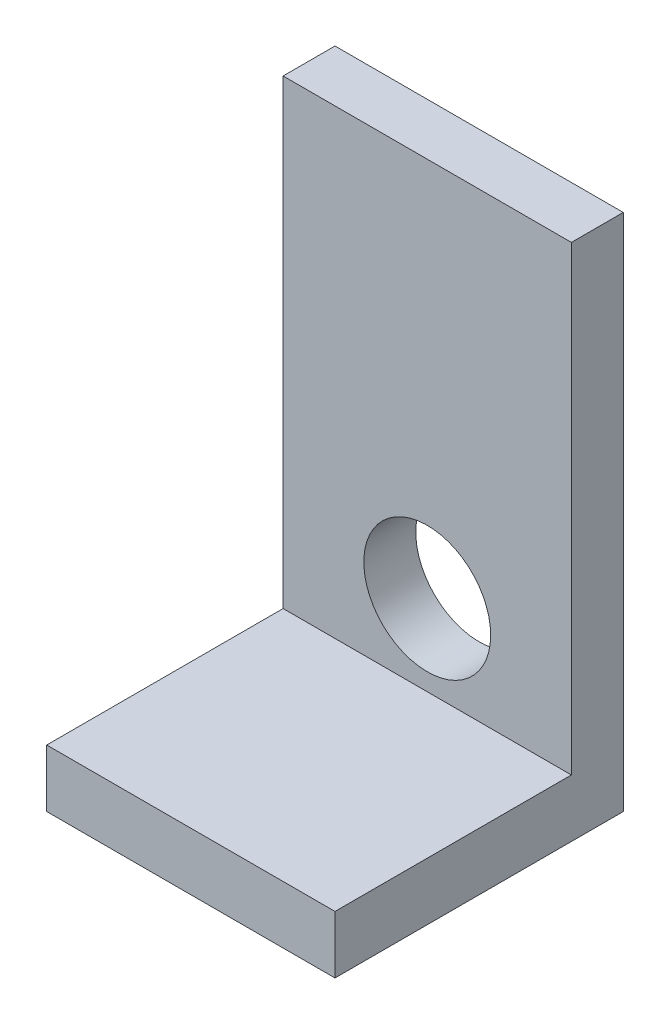
ISO-10303-21;
HEADER;
FILE_DESCRIPTION(('STEP AP214'),'2;1');
FILE_NAME('part.step','',(''),(''),'','','');
FILE_SCHEMA(('AUTOMOTIVE_DESIGN { 1 0 10303 214 1 1 1 1 }'));
ENDSEC;
DATA;
#1=APPLICATION_CONTEXT('core data for automotive mechanical design processes');
#2=APPLICATION_PROTOCOL_DEFINITION('international standard','automotive_design',2000,#1);
#3=PRODUCT_CONTEXT('',#1,'mechanical');
#4=PRODUCT('Part','Part','',(#3));
#5=PRODUCT_RELATED_PRODUCT_CATEGORY('part','',(#4));
#6=PRODUCT_DEFINITION_FORMATION('','',#4);
#7=PRODUCT_DEFINITION_CONTEXT('part definition',#1,'design');
#8=PRODUCT_DEFINITION('design','',#6,#7);
#9=PRODUCT_DEFINITION_SHAPE('','',#8);
#10=(LENGTH_UNIT() NAMED_UNIT(*) SI_UNIT(.MILLI.,.METRE.));
#11=(NAMED_UNIT(*) PLANE_ANGLE_UNIT() SI_UNIT($,.RADIAN.));
#12=(NAMED_UNIT(*) SI_UNIT($,.STERADIAN.) SOLID_ANGLE_UNIT());
#13=UNCERTAINTY_MEASURE_WITH_UNIT(LENGTH_MEASURE(1.E-05),#10,'distance_accuracy_value','');
#14=(GEOMETRIC_REPRESENTATION_CONTEXT(3) GLOBAL_UNCERTAINTY_ASSIGNED_CONTEXT((#13)) GLOBAL_UNIT_ASSIGNED_CONTEXT((#10,
#11,#12)) REPRESENTATION_CONTEXT('',''));
#15=CARTESIAN_POINT('',(0.,0.,0.));
#16=DIRECTION('',(0.,0.,1.));
#17=DIRECTION('',(1.,0.,0.));
#18=AXIS2_PLACEMENT_3D('',#15,#16,#17);
#19=CARTESIAN_POINT('',(3.17499999999996,1.27,-3.175));
#20=DIRECTION('',(-1.,0.,0.));
#21=DIRECTION('',(0.,0.,1.));
#22=AXIS2_PLACEMENT_3D('',#19,#20,#21);
#23=PLANE('',#22);
#24=DIRECTION('',(0.,0.,-1.));
#25=VECTOR('',#24,1.);
#26=CARTESIAN_POINT('',(3.17499999999996,0.,-3.175));
#27=LINE('',#26,#25);
#28=CARTESIAN_POINT('',(3.17499999999996,0.,3.175));
#29=VERTEX_POINT('',#28);
#30=CARTESIAN_POINT('',(3.17499999999996,0.,-3.175));
#31=VERTEX_POINT('',#30);
#32=EDGE_CURVE('E88',#29,#31,#27,.T.);
#33=ORIENTED_EDGE('',*,*,#32,.T.);
#34=DIRECTION('',(0.,-1.,0.));
#35=VECTOR('',#34,1.);
#36=CARTESIAN_POINT('',(3.17499999999996,1.27,-3.175));
#37=LINE('',#36,#35);
#38=CARTESIAN_POINT('',(3.17499999999996,11.43,-3.175));
#39=VERTEX_POINT('',#38);
#40=EDGE_CURVE('E11',#39,#31,#37,.T.);
#41=ORIENTED_EDGE('',*,*,#40,.F.);
#42=DIRECTION('',(0.,0.,-1.));
#43=VECTOR('',#42,1.);
#44=CARTESIAN_POINT('',(3.17499999999996,11.43,-3.175));
#45=LINE('',#44,#43);
#46=CARTESIAN_POINT('',(3.17499999999996,11.43,-2.032));
#47=VERTEX_POINT('',#46);
#48=EDGE_CURVE('E124',#47,#39,#45,.T.);
#49=ORIENTED_EDGE('',*,*,#48,.F.);
#50=DIRECTION('',(0.,-1.,0.));
#51=VECTOR('',#50,1.);
#52=CARTESIAN_POINT('',(3.17499999999996,11.43,-2.032));
#53=LINE('',#52,#51);
#54=CARTESIAN_POINT('',(3.17499999999996,1.27,-2.032));
#55=VERTEX_POINT('',#54);
#56=EDGE_CURVE('E97',#47,#55,#53,.T.);
#57=ORIENTED_EDGE('',*,*,#56,.T.);
#58=DIRECTION('',(0.,0.,-1.));
#59=VECTOR('',#58,1.);
#60=CARTESIAN_POINT('',(3.17499999999996,1.27,-3.175));
#61=LINE('',#60,#59);
#62=CARTESIAN_POINT('',(3.17499999999996,1.27,3.175));
#63=VERTEX_POINT('',#62);
#64=EDGE_CURVE('E82',#63,#55,#61,.T.);
#65=ORIENTED_EDGE('',*,*,#64,.F.);
#66=DIRECTION('',(0.,-1.,0.));
#67=VECTOR('',#66,1.);
#68=CARTESIAN_POINT('',(3.17499999999996,1.27,3.175));
#69=LINE('',#68,#67);
#70=EDGE_CURVE('E75',#63,#29,#69,.T.);
#71=ORIENTED_EDGE('',*,*,#70,.T.);
#72=EDGE_LOOP('',(#33,#41,#49,#57,#65,#71));
#73=FACE_BOUND('',#72,.T.);
#74=ADVANCED_FACE('F33',(#73),#23,.F.);
#75=CARTESIAN_POINT('',(-3.17500000000003,1.27,-3.175));
#76=DIRECTION('',(0.,0.,1.));
#77=DIRECTION('',(1.,0.,0.));
#78=AXIS2_PLACEMENT_3D('',#75,#76,#77);
#79=PLANE('',#78);
#80=CARTESIAN_POINT('',(0.,3.048,-3.175));
#81=DIRECTION('',(0.,0.,1.));
#82=DIRECTION('',(1.,0.,0.));
#83=AXIS2_PLACEMENT_3D('',#80,#81,#82);
#84=CIRCLE('',#83,1.397);
#85=CARTESIAN_POINT('',(1.397,3.048,-3.175));
#86=VERTEX_POINT('',#85);
#87=EDGE_CURVE('E131',#86,#86,#84,.F.);
#88=ORIENTED_EDGE('',*,*,#87,.F.);
#89=EDGE_LOOP('',(#88));
#90=FACE_BOUND('',#89,.T.);
#91=DIRECTION('',(-1.,0.,0.));
#92=VECTOR('',#91,1.);
#93=CARTESIAN_POINT('',(-3.17500000000003,0.,-3.175));
#94=LINE('',#93,#92);
#95=CARTESIAN_POINT('',(-3.17500000000003,0.,-3.175));
#96=VERTEX_POINT('',#95);
#97=EDGE_CURVE('E92',#31,#96,#94,.T.);
#98=ORIENTED_EDGE('',*,*,#97,.T.);
#99=DIRECTION('',(0.,-1.,0.));
#100=VECTOR('',#99,1.);
#101=CARTESIAN_POINT('',(-3.17500000000003,1.27,-3.175));
#102=LINE('',#101,#100);
#103=CARTESIAN_POINT('',(-3.17500000000003,11.43,-3.175));
#104=VERTEX_POINT('',#103);
#105=EDGE_CURVE('E40',#104,#96,#102,.T.);
#106=ORIENTED_EDGE('',*,*,#105,.F.);
#107=DIRECTION('',(-1.,0.,0.));
#108=VECTOR('',#107,1.);
#109=CARTESIAN_POINT('',(-3.17500000000003,11.43,-3.175));
#110=LINE('',#109,#108);
#111=EDGE_CURVE('E116',#39,#104,#110,.T.);
#112=ORIENTED_EDGE('',*,*,#111,.F.);
#113=ORIENTED_EDGE('',*,*,#40,.T.);
#114=EDGE_LOOP('',(#98,#106,#112,#113));
#115=FACE_BOUND('',#114,.T.);
#116=ADVANCED_FACE('F114',(#90,#115),#79,.F.);
#117=CARTESIAN_POINT('',(-3.17500000000003,1.27,-3.175));
#118=DIRECTION('',(1.,0.,0.));
#119=DIRECTION('',(0.,0.,-1.));
#120=AXIS2_PLACEMENT_3D('',#117,#118,#119);
#121=PLANE('',#120);
#122=DIRECTION('',(0.,0.,1.));
#123=VECTOR('',#122,1.);
#124=CARTESIAN_POINT('',(-3.17500000000003,0.,-3.175));
#125=LINE('',#124,#123);
#126=CARTESIAN_POINT('',(-3.17500000000003,0.,3.175));
#127=VERTEX_POINT('',#126);
#128=EDGE_CURVE('E83',#96,#127,#125,.T.);
#129=ORIENTED_EDGE('',*,*,#128,.T.);
#130=DIRECTION('',(0.,-1.,0.));
#131=VECTOR('',#130,1.);
#132=CARTESIAN_POINT('',(-3.17500000000003,1.27,3.175));
#133=LINE('',#132,#131);
#134=CARTESIAN_POINT('',(-3.17500000000003,1.27,3.175));
#135=VERTEX_POINT('',#134);
#136=EDGE_CURVE('E78',#135,#127,#133,.T.);
#137=ORIENTED_EDGE('',*,*,#136,.F.);
#138=DIRECTION('',(0.,0.,1.));
#139=VECTOR('',#138,1.);
#140=CARTESIAN_POINT('',(-3.17500000000003,1.27,-3.175));
#141=LINE('',#140,#139);
#142=CARTESIAN_POINT('',(-3.17500000000003,1.27,-2.032));
#143=VERTEX_POINT('',#142);
#144=EDGE_CURVE('E133',#143,#135,#141,.T.);
#145=ORIENTED_EDGE('',*,*,#144,.F.);
#146=DIRECTION('',(0.,-1.,0.));
#147=VECTOR('',#146,1.);
#148=CARTESIAN_POINT('',(-3.17500000000003,11.43,-2.032));
#149=LINE('',#148,#147);
#150=CARTESIAN_POINT('',(-3.17500000000003,11.43,-2.032));
#151=VERTEX_POINT('',#150);
#152=EDGE_CURVE('E93',#151,#143,#149,.T.);
#153=ORIENTED_EDGE('',*,*,#152,.F.);
#154=DIRECTION('',(0.,0.,1.));
#155=VECTOR('',#154,1.);
#156=CARTESIAN_POINT('',(-3.17500000000003,11.43,-3.175));
#157=LINE('',#156,#155);
#158=EDGE_CURVE('E110',#104,#151,#157,.T.);
#159=ORIENTED_EDGE('',*,*,#158,.F.);
#160=ORIENTED_EDGE('',*,*,#105,.T.);
#161=EDGE_LOOP('',(#129,#137,#145,#153,#159,#160));
#162=FACE_BOUND('',#161,.T.);
#163=ADVANCED_FACE('F107',(#162),#121,.F.);
#164=CARTESIAN_POINT('',(-3.17500000000003,1.27,3.175));
#165=DIRECTION('',(0.,0.,-1.));
#166=DIRECTION('',(-1.,0.,0.));
#167=AXIS2_PLACEMENT_3D('',#164,#165,#166);
#168=PLANE('',#167);
#169=DIRECTION('',(1.,0.,0.));
#170=VECTOR('',#169,1.);
#171=CARTESIAN_POINT('',(-3.17500000000003,0.,3.175));
#172=LINE('',#171,#170);
#173=EDGE_CURVE('E72',#127,#29,#172,.T.);
#174=ORIENTED_EDGE('',*,*,#173,.T.);
#175=ORIENTED_EDGE('',*,*,#70,.F.);
#176=DIRECTION('',(1.,0.,0.));
#177=VECTOR('',#176,1.);
#178=CARTESIAN_POINT('',(-3.17500000000003,1.27,3.175));
#179=LINE('',#178,#177);
#180=EDGE_CURVE('E53',#135,#63,#179,.T.);
#181=ORIENTED_EDGE('',*,*,#180,.F.);
#182=ORIENTED_EDGE('',*,*,#136,.T.);
#183=EDGE_LOOP('',(#174,#175,#181,#182));
#184=FACE_BOUND('',#183,.T.);
#185=ADVANCED_FACE('F74',(#184),#168,.F.);
#186=CARTESIAN_POINT('',(0.,1.27,0.));
#187=DIRECTION('',(0.,1.,0.));
#188=DIRECTION('',(0.,0.,1.));
#189=AXIS2_PLACEMENT_3D('',#186,#187,#188);
#190=PLANE('',#189);
#191=DIRECTION('',(1.,0.,0.));
#192=VECTOR('',#191,1.);
#193=CARTESIAN_POINT('',(-3.17500000000003,1.27,-2.032));
#194=LINE('',#193,#192);
#195=EDGE_CURVE('E47',#143,#55,#194,.T.);
#196=ORIENTED_EDGE('',*,*,#195,.F.);
#197=ORIENTED_EDGE('',*,*,#144,.T.);
#198=ORIENTED_EDGE('',*,*,#180,.T.);
#199=ORIENTED_EDGE('',*,*,#64,.T.);
#200=EDGE_LOOP('',(#196,#197,#198,#199));
#201=FACE_BOUND('',#200,.T.);
#202=ADVANCED_FACE('F134',(#201),#190,.T.);
#203=CARTESIAN_POINT('',(0.,0.,0.));
#204=DIRECTION('',(0.,1.,0.));
#205=DIRECTION('',(0.,0.,1.));
#206=AXIS2_PLACEMENT_3D('',#203,#204,#205);
#207=PLANE('',#206);
#208=ORIENTED_EDGE('',*,*,#32,.F.);
#209=ORIENTED_EDGE('',*,*,#173,.F.);
#210=ORIENTED_EDGE('',*,*,#128,.F.);
#211=ORIENTED_EDGE('',*,*,#97,.F.);
#212=EDGE_LOOP('',(#208,#209,#210,#211));
#213=FACE_BOUND('',#212,.T.);
#214=ADVANCED_FACE('F91',(#213),#207,.F.);
#215=CARTESIAN_POINT('',(-3.17500000000003,11.43,-2.032));
#216=DIRECTION('',(0.,0.,-1.));
#217=DIRECTION('',(-1.,0.,0.));
#218=AXIS2_PLACEMENT_3D('',#215,#216,#217);
#219=PLANE('',#218);
#220=CARTESIAN_POINT('',(0.,3.048,-2.032));
#221=DIRECTION('',(0.,0.,1.));
#222=DIRECTION('',(1.,0.,0.));
#223=AXIS2_PLACEMENT_3D('',#220,#221,#222);
#224=CIRCLE('',#223,1.397);
#225=CARTESIAN_POINT('',(1.397,3.048,-2.032));
#226=VERTEX_POINT('',#225);
#227=EDGE_CURVE('E146',#226,#226,#224,.T.);
#228=ORIENTED_EDGE('',*,*,#227,.F.);
#229=EDGE_LOOP('',(#228));
#230=FACE_BOUND('',#229,.T.);
#231=ORIENTED_EDGE('',*,*,#195,.T.);
#232=ORIENTED_EDGE('',*,*,#56,.F.);
#233=DIRECTION('',(1.,0.,0.));
#234=VECTOR('',#233,1.);
#235=CARTESIAN_POINT('',(-3.17500000000003,11.43,-2.032));
#236=LINE('',#235,#234);
#237=EDGE_CURVE('E127',#151,#47,#236,.T.);
#238=ORIENTED_EDGE('',*,*,#237,.F.);
#239=ORIENTED_EDGE('',*,*,#152,.T.);
#240=EDGE_LOOP('',(#231,#232,#238,#239));
#241=FACE_BOUND('',#240,.T.);
#242=ADVANCED_FACE('F137',(#230,#241),#219,.F.);
#243=CARTESIAN_POINT('',(0.,11.43,0.));
#244=DIRECTION('',(0.,1.,0.));
#245=DIRECTION('',(0.,0.,1.));
#246=AXIS2_PLACEMENT_3D('',#243,#244,#245);
#247=PLANE('',#246);
#248=ORIENTED_EDGE('',*,*,#158,.T.);
#249=ORIENTED_EDGE('',*,*,#237,.T.);
#250=ORIENTED_EDGE('',*,*,#48,.T.);
#251=ORIENTED_EDGE('',*,*,#111,.T.);
#252=EDGE_LOOP('',(#248,#249,#250,#251));
#253=FACE_BOUND('',#252,.T.);
#254=ADVANCED_FACE('F120',(#253),#247,.T.);
#255=CARTESIAN_POINT('',(0.,3.048,-3.176));
#256=DIRECTION('',(0.,0.,1.));
#257=DIRECTION('',(1.,0.,0.));
#258=AXIS2_PLACEMENT_3D('',#255,#256,#257);
#259=CYLINDRICAL_SURFACE('',#258,1.397);
#260=ORIENTED_EDGE('',*,*,#227,.T.);
#261=EDGE_LOOP('',(#260));
#262=FACE_BOUND('',#261,.T.);
#263=ORIENTED_EDGE('',*,*,#87,.T.);
#264=EDGE_LOOP('',(#263));
#265=FACE_BOUND('',#264,.T.);
#266=ADVANCED_FACE('F150',(#262,#265),#259,.F.);
#267=CLOSED_SHELL('',(#74,#116,#163,#185,#202,#214,#242,#254,#266));
#268=MANIFOLD_SOLID_BREP('B2',#267);
#269=ADVANCED_BREP_SHAPE_REPRESENTATION('',(#18,#268),#14);
#270=SHAPE_DEFINITION_REPRESENTATION(#9,#269);
ENDSEC;
END-ISO-10303-21;
